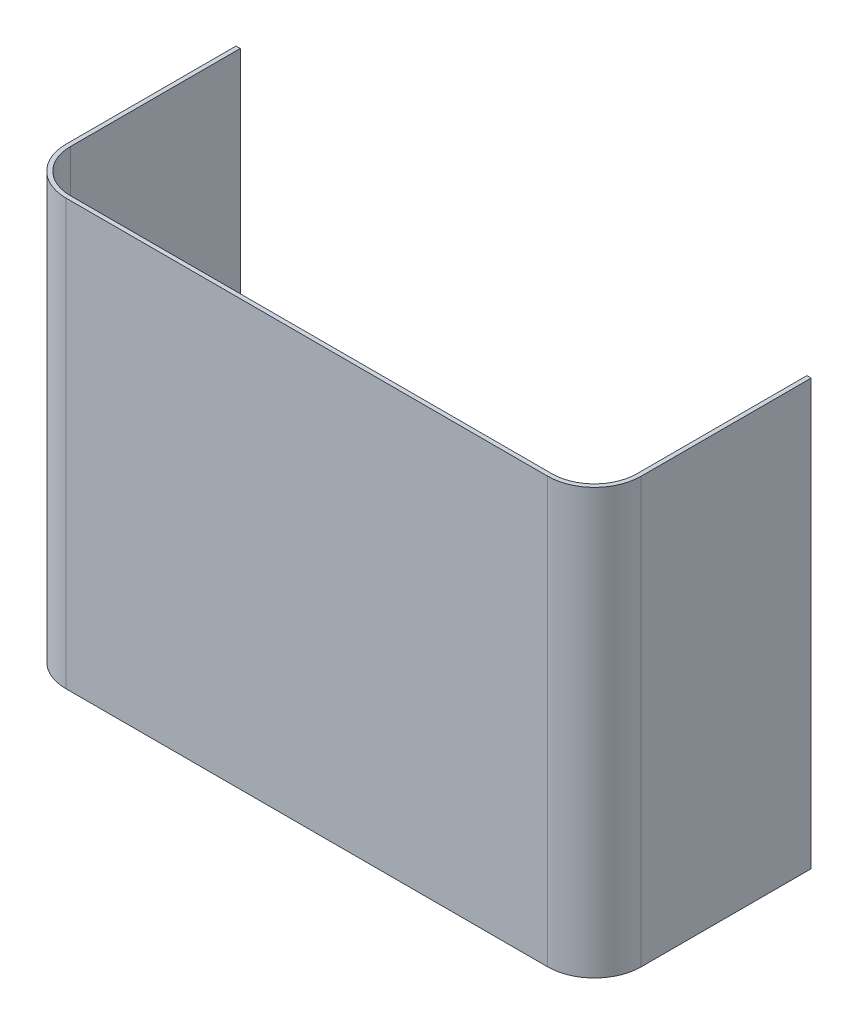
ISO-10303-21;
HEADER;
FILE_DESCRIPTION(('STEP AP214'),'2;1');
FILE_NAME('part.step','',(''),(''),'','','');
FILE_SCHEMA(('AUTOMOTIVE_DESIGN { 1 0 10303 214 1 1 1 1 }'));
ENDSEC;
DATA;
#1=APPLICATION_CONTEXT('core data for automotive mechanical design processes');
#2=APPLICATION_PROTOCOL_DEFINITION('international standard','automotive_design',2000,#1);
#3=PRODUCT_CONTEXT('',#1,'mechanical');
#4=PRODUCT('Part','Part','',(#3));
#5=PRODUCT_RELATED_PRODUCT_CATEGORY('part','',(#4));
#6=PRODUCT_DEFINITION_FORMATION('','',#4);
#7=PRODUCT_DEFINITION_CONTEXT('part definition',#1,'design');
#8=PRODUCT_DEFINITION('design','',#6,#7);
#9=PRODUCT_DEFINITION_SHAPE('','',#8);
#10=(LENGTH_UNIT() NAMED_UNIT(*) SI_UNIT(.MILLI.,.METRE.));
#11=(NAMED_UNIT(*) PLANE_ANGLE_UNIT() SI_UNIT($,.RADIAN.));
#12=(NAMED_UNIT(*) SI_UNIT($,.STERADIAN.) SOLID_ANGLE_UNIT());
#13=UNCERTAINTY_MEASURE_WITH_UNIT(LENGTH_MEASURE(1.E-05),#10,'distance_accuracy_value','');
#14=(GEOMETRIC_REPRESENTATION_CONTEXT(3) GLOBAL_UNCERTAINTY_ASSIGNED_CONTEXT((#13)) GLOBAL_UNIT_ASSIGNED_CONTEXT((#10,
#11,#12)) REPRESENTATION_CONTEXT('',''));
#15=CARTESIAN_POINT('',(0.,0.,0.));
#16=DIRECTION('',(0.,0.,1.));
#17=DIRECTION('',(1.,0.,0.));
#18=AXIS2_PLACEMENT_3D('',#15,#16,#17);
#19=CARTESIAN_POINT('',(-170.,0.,45.));
#20=DIRECTION('',(0.,-1.,0.));
#21=DIRECTION('',(0.,0.,-1.));
#22=AXIS2_PLACEMENT_3D('',#19,#20,#21);
#23=PLANE('',#22);
#24=DIRECTION('',(0.,0.,1.));
#25=VECTOR('',#24,1.);
#26=CARTESIAN_POINT('',(-203.,0.,45.));
#27=LINE('',#26,#25);
#28=CARTESIAN_POINT('',(-203.,0.,-75.));
#29=VERTEX_POINT('',#28);
#30=CARTESIAN_POINT('',(-203.,0.,45.));
#31=VERTEX_POINT('',#30);
#32=EDGE_CURVE('E40',#29,#31,#27,.T.);
#33=ORIENTED_EDGE('',*,*,#32,.F.);
#34=DIRECTION('',(1.,0.,0.));
#35=VECTOR('',#34,1.);
#36=CARTESIAN_POINT('',(-170.,0.,-75.));
#37=LINE('',#36,#35);
#38=CARTESIAN_POINT('',(-200.,0.,-75.));
#39=VERTEX_POINT('',#38);
#40=EDGE_CURVE('E181',#29,#39,#37,.T.);
#41=ORIENTED_EDGE('',*,*,#40,.T.);
#42=DIRECTION('',(0.,0.,1.));
#43=VECTOR('',#42,1.);
#44=CARTESIAN_POINT('',(-200.,0.,45.));
#45=LINE('',#44,#43);
#46=CARTESIAN_POINT('',(-200.,0.,45.));
#47=VERTEX_POINT('',#46);
#48=EDGE_CURVE('E172',#39,#47,#45,.T.);
#49=ORIENTED_EDGE('',*,*,#48,.T.);
#50=CARTESIAN_POINT('',(-170.,0.,45.));
#51=DIRECTION('',(0.,1.,0.));
#52=DIRECTION('',(0.,0.,-1.));
#53=AXIS2_PLACEMENT_3D('',#50,#51,#52);
#54=CIRCLE('',#53,30.);
#55=CARTESIAN_POINT('',(-170.,0.,75.));
#56=VERTEX_POINT('',#55);
#57=EDGE_CURVE('E164',#47,#56,#54,.T.);
#58=ORIENTED_EDGE('',*,*,#57,.T.);
#59=DIRECTION('',(1.,0.,0.));
#60=VECTOR('',#59,1.);
#61=CARTESIAN_POINT('',(-170.,0.,75.));
#62=LINE('',#61,#60);
#63=CARTESIAN_POINT('',(170.,0.,75.));
#64=VERTEX_POINT('',#63);
#65=EDGE_CURVE('E157',#56,#64,#62,.T.);
#66=ORIENTED_EDGE('',*,*,#65,.T.);
#67=CARTESIAN_POINT('',(170.,0.,45.));
#68=DIRECTION('',(0.,1.,0.));
#69=DIRECTION('',(0.,0.,-1.));
#70=AXIS2_PLACEMENT_3D('',#67,#68,#69);
#71=CIRCLE('',#70,30.);
#72=CARTESIAN_POINT('',(200.,0.,45.));
#73=VERTEX_POINT('',#72);
#74=EDGE_CURVE('E152',#64,#73,#71,.T.);
#75=ORIENTED_EDGE('',*,*,#74,.T.);
#76=DIRECTION('',(0.,0.,-1.));
#77=VECTOR('',#76,1.);
#78=CARTESIAN_POINT('',(200.,0.,45.));
#79=LINE('',#78,#77);
#80=CARTESIAN_POINT('',(200.,0.,-75.));
#81=VERTEX_POINT('',#80);
#82=EDGE_CURVE('E149',#73,#81,#79,.T.);
#83=ORIENTED_EDGE('',*,*,#82,.T.);
#84=CARTESIAN_POINT('',(203.,0.,-75.));
#85=VERTEX_POINT('',#84);
#86=EDGE_CURVE('E192',#81,#85,#37,.T.);
#87=ORIENTED_EDGE('',*,*,#86,.T.);
#88=DIRECTION('',(0.,0.,-1.));
#89=VECTOR('',#88,1.);
#90=CARTESIAN_POINT('',(203.,0.,45.));
#91=LINE('',#90,#89);
#92=CARTESIAN_POINT('',(203.,0.,45.));
#93=VERTEX_POINT('',#92);
#94=EDGE_CURVE('E131',#93,#85,#91,.T.);
#95=ORIENTED_EDGE('',*,*,#94,.F.);
#96=CARTESIAN_POINT('',(170.,0.,45.));
#97=DIRECTION('',(0.,-1.,0.));
#98=DIRECTION('',(0.,0.,-1.));
#99=AXIS2_PLACEMENT_3D('',#96,#97,#98);
#100=CIRCLE('',#99,33.);
#101=CARTESIAN_POINT('',(170.,0.,78.));
#102=VERTEX_POINT('',#101);
#103=EDGE_CURVE('E136',#102,#93,#100,.F.);
#104=ORIENTED_EDGE('',*,*,#103,.F.);
#105=DIRECTION('',(1.,0.,0.));
#106=VECTOR('',#105,1.);
#107=CARTESIAN_POINT('',(-170.,0.,78.));
#108=LINE('',#107,#106);
#109=CARTESIAN_POINT('',(-170.,0.,78.));
#110=VERTEX_POINT('',#109);
#111=EDGE_CURVE('E139',#110,#102,#108,.T.);
#112=ORIENTED_EDGE('',*,*,#111,.F.);
#113=CARTESIAN_POINT('',(-170.,0.,45.));
#114=DIRECTION('',(0.,-1.,0.));
#115=DIRECTION('',(0.,0.,-1.));
#116=AXIS2_PLACEMENT_3D('',#113,#114,#115);
#117=CIRCLE('',#116,33.);
#118=EDGE_CURVE('E123',#31,#110,#117,.F.);
#119=ORIENTED_EDGE('',*,*,#118,.F.);
#120=EDGE_LOOP('',(#33,#41,#49,#58,#66,#75,#83,#87,#95,#104,#112,#119));
#121=FACE_BOUND('',#120,.T.);
#122=ADVANCED_FACE('F36',(#121),#23,.T.);
#123=CARTESIAN_POINT('',(-170.,300.,44.999999999999));
#124=DIRECTION('',(0.,-1.,0.));
#125=DIRECTION('',(0.,0.,-1.));
#126=AXIS2_PLACEMENT_3D('',#123,#124,#125);
#127=PLANE('',#126);
#128=DIRECTION('',(1.,0.,0.));
#129=VECTOR('',#128,1.);
#130=CARTESIAN_POINT('',(-170.,300.,-75.000000000001));
#131=LINE('',#130,#129);
#132=CARTESIAN_POINT('',(-203.,300.,-75.000000000001));
#133=VERTEX_POINT('',#132);
#134=CARTESIAN_POINT('',(-200.,300.,-75.000000000001));
#135=VERTEX_POINT('',#134);
#136=EDGE_CURVE('E188',#133,#135,#131,.T.);
#137=ORIENTED_EDGE('',*,*,#136,.F.);
#138=DIRECTION('',(0.,0.,1.));
#139=VECTOR('',#138,1.);
#140=CARTESIAN_POINT('',(-203.,300.,45.));
#141=LINE('',#140,#139);
#142=CARTESIAN_POINT('',(-203.,300.,44.999999999999));
#143=VERTEX_POINT('',#142);
#144=EDGE_CURVE('E106',#133,#143,#141,.T.);
#145=ORIENTED_EDGE('',*,*,#144,.T.);
#146=CARTESIAN_POINT('',(-170.,300.,44.999999999999));
#147=DIRECTION('',(0.,-1.,0.));
#148=DIRECTION('',(0.,0.,-1.));
#149=AXIS2_PLACEMENT_3D('',#146,#147,#148);
#150=CIRCLE('',#149,33.);
#151=CARTESIAN_POINT('',(-170.,300.,77.999999999999));
#152=VERTEX_POINT('',#151);
#153=EDGE_CURVE('E100',#143,#152,#150,.F.);
#154=ORIENTED_EDGE('',*,*,#153,.T.);
#155=DIRECTION('',(1.,0.,0.));
#156=VECTOR('',#155,1.);
#157=CARTESIAN_POINT('',(-170.,300.,77.999999999999));
#158=LINE('',#157,#156);
#159=CARTESIAN_POINT('',(170.,300.,77.999999999999));
#160=VERTEX_POINT('',#159);
#161=EDGE_CURVE('E104',#152,#160,#158,.T.);
#162=ORIENTED_EDGE('',*,*,#161,.T.);
#163=CARTESIAN_POINT('',(170.,300.,44.999999999999));
#164=DIRECTION('',(0.,-1.,0.));
#165=DIRECTION('',(0.,0.,-1.));
#166=AXIS2_PLACEMENT_3D('',#163,#164,#165);
#167=CIRCLE('',#166,33.);
#168=CARTESIAN_POINT('',(203.,300.,44.999999999999));
#169=VERTEX_POINT('',#168);
#170=EDGE_CURVE('E61',#160,#169,#167,.F.);
#171=ORIENTED_EDGE('',*,*,#170,.T.);
#172=DIRECTION('',(0.,0.,-1.));
#173=VECTOR('',#172,1.);
#174=CARTESIAN_POINT('',(203.,300.,45.));
#175=LINE('',#174,#173);
#176=CARTESIAN_POINT('',(203.,300.,-75.000000000001));
#177=VERTEX_POINT('',#176);
#178=EDGE_CURVE('E11',#169,#177,#175,.T.);
#179=ORIENTED_EDGE('',*,*,#178,.T.);
#180=CARTESIAN_POINT('',(200.,300.,-75.000000000001));
#181=VERTEX_POINT('',#180);
#182=EDGE_CURVE('E195',#181,#177,#131,.T.);
#183=ORIENTED_EDGE('',*,*,#182,.F.);
#184=DIRECTION('',(0.,0.,-1.));
#185=VECTOR('',#184,1.);
#186=CARTESIAN_POINT('',(200.,300.,44.999999999999));
#187=LINE('',#186,#185);
#188=CARTESIAN_POINT('',(200.,300.,44.999999999999));
#189=VERTEX_POINT('',#188);
#190=EDGE_CURVE('E140',#189,#181,#187,.T.);
#191=ORIENTED_EDGE('',*,*,#190,.F.);
#192=CARTESIAN_POINT('',(170.,300.,44.999999999999));
#193=DIRECTION('',(0.,1.,0.));
#194=DIRECTION('',(0.,0.,-1.));
#195=AXIS2_PLACEMENT_3D('',#192,#193,#194);
#196=CIRCLE('',#195,30.);
#197=CARTESIAN_POINT('',(170.,300.,74.999999999999));
#198=VERTEX_POINT('',#197);
#199=EDGE_CURVE('E88',#198,#189,#196,.T.);
#200=ORIENTED_EDGE('',*,*,#199,.F.);
#201=DIRECTION('',(1.,0.,0.));
#202=VECTOR('',#201,1.);
#203=CARTESIAN_POINT('',(-170.,300.,74.999999999999));
#204=LINE('',#203,#202);
#205=CARTESIAN_POINT('',(-170.,300.,74.999999999999));
#206=VERTEX_POINT('',#205);
#207=EDGE_CURVE('E159',#206,#198,#204,.T.);
#208=ORIENTED_EDGE('',*,*,#207,.F.);
#209=CARTESIAN_POINT('',(-170.,300.,44.999999999999));
#210=DIRECTION('',(0.,1.,0.));
#211=DIRECTION('',(0.,0.,-1.));
#212=AXIS2_PLACEMENT_3D('',#209,#210,#211);
#213=CIRCLE('',#212,30.);
#214=CARTESIAN_POINT('',(-200.,300.,44.999999999999));
#215=VERTEX_POINT('',#214);
#216=EDGE_CURVE('E167',#215,#206,#213,.T.);
#217=ORIENTED_EDGE('',*,*,#216,.F.);
#218=DIRECTION('',(0.,0.,1.));
#219=VECTOR('',#218,1.);
#220=CARTESIAN_POINT('',(-200.,300.,44.999999999999));
#221=LINE('',#220,#219);
#222=EDGE_CURVE('E175',#135,#215,#221,.T.);
#223=ORIENTED_EDGE('',*,*,#222,.F.);
#224=EDGE_LOOP('',(#137,#145,#154,#162,#171,#179,#183,#191,#200,#208,#217,#223));
#225=FACE_BOUND('',#224,.T.);
#226=ADVANCED_FACE('F103',(#225),#127,.F.);
#227=CARTESIAN_POINT('',(-203.,0.,45.));
#228=DIRECTION('',(-1.,0.,0.));
#229=DIRECTION('',(0.,0.,1.));
#230=AXIS2_PLACEMENT_3D('',#227,#228,#229);
#231=PLANE('',#230);
#232=ORIENTED_EDGE('',*,*,#144,.F.);
#233=DIRECTION('',(0.,-1.,0.));
#234=VECTOR('',#233,1.);
#235=CARTESIAN_POINT('',(-203.,-4.04834597446372E-13,-75.));
#236=LINE('',#235,#234);
#237=EDGE_CURVE('E186',#133,#29,#236,.T.);
#238=ORIENTED_EDGE('',*,*,#237,.T.);
#239=ORIENTED_EDGE('',*,*,#32,.T.);
#240=DIRECTION('',(0.,1.,0.));
#241=VECTOR('',#240,1.);
#242=CARTESIAN_POINT('',(-203.,0.,45.));
#243=LINE('',#242,#241);
#244=EDGE_CURVE('E111',#31,#143,#243,.T.);
#245=ORIENTED_EDGE('',*,*,#244,.T.);
#246=EDGE_LOOP('',(#232,#238,#239,#245));
#247=FACE_BOUND('',#246,.T.);
#248=ADVANCED_FACE('F264',(#247),#231,.T.);
#249=CARTESIAN_POINT('',(203.,0.,45.));
#250=DIRECTION('',(1.,0.,0.));
#251=DIRECTION('',(0.,0.,-1.));
#252=AXIS2_PLACEMENT_3D('',#249,#250,#251);
#253=PLANE('',#252);
#254=ORIENTED_EDGE('',*,*,#94,.T.);
#255=DIRECTION('',(0.,1.,0.));
#256=VECTOR('',#255,1.);
#257=CARTESIAN_POINT('',(203.,-4.04834597446372E-13,-75.));
#258=LINE('',#257,#256);
#259=EDGE_CURVE('E189',#85,#177,#258,.T.);
#260=ORIENTED_EDGE('',*,*,#259,.T.);
#261=ORIENTED_EDGE('',*,*,#178,.F.);
#262=DIRECTION('',(0.,1.,0.));
#263=VECTOR('',#262,1.);
#264=CARTESIAN_POINT('',(203.,0.,45.));
#265=LINE('',#264,#263);
#266=EDGE_CURVE('E45',#93,#169,#265,.T.);
#267=ORIENTED_EDGE('',*,*,#266,.F.);
#268=EDGE_LOOP('',(#254,#260,#261,#267));
#269=FACE_BOUND('',#268,.T.);
#270=ADVANCED_FACE('F38',(#269),#253,.T.);
#271=CARTESIAN_POINT('',(-170.,0.,45.));
#272=DIRECTION('',(0.,1.,0.));
#273=DIRECTION('',(0.,0.,1.));
#274=AXIS2_PLACEMENT_3D('',#271,#272,#273);
#275=CYLINDRICAL_SURFACE('',#274,33.);
#276=DIRECTION('',(0.,1.,0.));
#277=VECTOR('',#276,1.);
#278=CARTESIAN_POINT('',(-170.,1.11177549744637E-13,78.));
#279=LINE('',#278,#277);
#280=EDGE_CURVE('E110',#110,#152,#279,.T.);
#281=ORIENTED_EDGE('',*,*,#280,.T.);
#282=ORIENTED_EDGE('',*,*,#153,.F.);
#283=ORIENTED_EDGE('',*,*,#244,.F.);
#284=ORIENTED_EDGE('',*,*,#118,.T.);
#285=EDGE_LOOP('',(#281,#282,#283,#284));
#286=FACE_BOUND('',#285,.T.);
#287=ADVANCED_FACE('F122',(#286),#275,.T.);
#288=CARTESIAN_POINT('',(-170.,0.,78.));
#289=DIRECTION('',(0.,0.,1.));
#290=DIRECTION('',(0.,-1.,0.));
#291=AXIS2_PLACEMENT_3D('',#288,#289,#290);
#292=PLANE('',#291);
#293=DIRECTION('',(0.,-1.,0.));
#294=VECTOR('',#293,1.);
#295=CARTESIAN_POINT('',(170.,0.,78.));
#296=LINE('',#295,#294);
#297=EDGE_CURVE('E119',#102,#160,#296,.F.);
#298=ORIENTED_EDGE('',*,*,#297,.T.);
#299=ORIENTED_EDGE('',*,*,#161,.F.);
#300=ORIENTED_EDGE('',*,*,#280,.F.);
#301=ORIENTED_EDGE('',*,*,#111,.T.);
#302=EDGE_LOOP('',(#298,#299,#300,#301));
#303=FACE_BOUND('',#302,.T.);
#304=ADVANCED_FACE('F116',(#303),#292,.T.);
#305=CARTESIAN_POINT('',(170.,0.,45.));
#306=DIRECTION('',(0.,1.,0.));
#307=DIRECTION('',(0.,0.,1.));
#308=AXIS2_PLACEMENT_3D('',#305,#306,#307);
#309=CYLINDRICAL_SURFACE('',#308,33.);
#310=ORIENTED_EDGE('',*,*,#266,.T.);
#311=ORIENTED_EDGE('',*,*,#170,.F.);
#312=ORIENTED_EDGE('',*,*,#297,.F.);
#313=ORIENTED_EDGE('',*,*,#103,.T.);
#314=EDGE_LOOP('',(#310,#311,#312,#313));
#315=FACE_BOUND('',#314,.T.);
#316=ADVANCED_FACE('F248',(#315),#309,.T.);
#317=CARTESIAN_POINT('',(-200.,0.,45.));
#318=DIRECTION('',(-1.,0.,0.));
#319=DIRECTION('',(0.,0.,1.));
#320=AXIS2_PLACEMENT_3D('',#317,#318,#319);
#321=PLANE('',#320);
#322=DIRECTION('',(0.,1.,0.));
#323=VECTOR('',#322,1.);
#324=CARTESIAN_POINT('',(-200.,0.,45.));
#325=LINE('',#324,#323);
#326=EDGE_CURVE('E169',#47,#215,#325,.T.);
#327=ORIENTED_EDGE('',*,*,#326,.F.);
#328=ORIENTED_EDGE('',*,*,#48,.F.);
#329=DIRECTION('',(0.,1.,0.));
#330=VECTOR('',#329,1.);
#331=CARTESIAN_POINT('',(-200.,0.,-75.));
#332=LINE('',#331,#330);
#333=EDGE_CURVE('E178',#39,#135,#332,.T.);
#334=ORIENTED_EDGE('',*,*,#333,.T.);
#335=ORIENTED_EDGE('',*,*,#222,.T.);
#336=EDGE_LOOP('',(#327,#328,#334,#335));
#337=FACE_BOUND('',#336,.T.);
#338=ADVANCED_FACE('F218',(#337),#321,.F.);
#339=CARTESIAN_POINT('',(-170.,0.,45.));
#340=DIRECTION('',(0.,1.,0.));
#341=DIRECTION('',(0.,0.,1.));
#342=AXIS2_PLACEMENT_3D('',#339,#340,#341);
#343=CYLINDRICAL_SURFACE('',#342,30.);
#344=DIRECTION('',(0.,1.,0.));
#345=VECTOR('',#344,1.);
#346=CARTESIAN_POINT('',(-170.,0.,75.));
#347=LINE('',#346,#345);
#348=EDGE_CURVE('E161',#56,#206,#347,.T.);
#349=ORIENTED_EDGE('',*,*,#348,.F.);
#350=ORIENTED_EDGE('',*,*,#57,.F.);
#351=ORIENTED_EDGE('',*,*,#326,.T.);
#352=ORIENTED_EDGE('',*,*,#216,.T.);
#353=EDGE_LOOP('',(#349,#350,#351,#352));
#354=FACE_BOUND('',#353,.T.);
#355=ADVANCED_FACE('F227',(#354),#343,.F.);
#356=CARTESIAN_POINT('',(-170.,0.,75.));
#357=DIRECTION('',(0.,0.,1.));
#358=DIRECTION('',(0.,-1.,0.));
#359=AXIS2_PLACEMENT_3D('',#356,#357,#358);
#360=PLANE('',#359);
#361=DIRECTION('',(0.,1.,0.));
#362=VECTOR('',#361,1.);
#363=CARTESIAN_POINT('',(170.,0.,75.));
#364=LINE('',#363,#362);
#365=EDGE_CURVE('E53',#64,#198,#364,.T.);
#366=ORIENTED_EDGE('',*,*,#365,.F.);
#367=ORIENTED_EDGE('',*,*,#65,.F.);
#368=ORIENTED_EDGE('',*,*,#348,.T.);
#369=ORIENTED_EDGE('',*,*,#207,.T.);
#370=EDGE_LOOP('',(#366,#367,#368,#369));
#371=FACE_BOUND('',#370,.T.);
#372=ADVANCED_FACE('F231',(#371),#360,.F.);
#373=CARTESIAN_POINT('',(170.,0.,45.));
#374=DIRECTION('',(0.,1.,0.));
#375=DIRECTION('',(0.,0.,1.));
#376=AXIS2_PLACEMENT_3D('',#373,#374,#375);
#377=CYLINDRICAL_SURFACE('',#376,30.);
#378=DIRECTION('',(0.,1.,0.));
#379=VECTOR('',#378,1.);
#380=CARTESIAN_POINT('',(200.,0.,45.));
#381=LINE('',#380,#379);
#382=EDGE_CURVE('E142',#73,#189,#381,.T.);
#383=ORIENTED_EDGE('',*,*,#382,.F.);
#384=ORIENTED_EDGE('',*,*,#74,.F.);
#385=ORIENTED_EDGE('',*,*,#365,.T.);
#386=ORIENTED_EDGE('',*,*,#199,.T.);
#387=EDGE_LOOP('',(#383,#384,#385,#386));
#388=FACE_BOUND('',#387,.T.);
#389=ADVANCED_FACE('F250',(#388),#377,.F.);
#390=CARTESIAN_POINT('',(200.,0.,45.));
#391=DIRECTION('',(1.,0.,0.));
#392=DIRECTION('',(0.,0.,-1.));
#393=AXIS2_PLACEMENT_3D('',#390,#391,#392);
#394=PLANE('',#393);
#395=ORIENTED_EDGE('',*,*,#190,.T.);
#396=DIRECTION('',(0.,1.,0.));
#397=VECTOR('',#396,1.);
#398=CARTESIAN_POINT('',(200.,0.,-75.));
#399=LINE('',#398,#397);
#400=EDGE_CURVE('E151',#81,#181,#399,.T.);
#401=ORIENTED_EDGE('',*,*,#400,.F.);
#402=ORIENTED_EDGE('',*,*,#82,.F.);
#403=ORIENTED_EDGE('',*,*,#382,.T.);
#404=EDGE_LOOP('',(#395,#401,#402,#403));
#405=FACE_BOUND('',#404,.T.);
#406=ADVANCED_FACE('F249',(#405),#394,.F.);
#407=CARTESIAN_POINT('',(0.,-2.53035438363357E-13,-75.));
#408=DIRECTION('',(0.,0.,-1.));
#409=DIRECTION('',(0.,1.,0.));
#410=AXIS2_PLACEMENT_3D('',#407,#408,#409);
#411=PLANE('',#410);
#412=ORIENTED_EDGE('',*,*,#86,.F.);
#413=ORIENTED_EDGE('',*,*,#400,.T.);
#414=ORIENTED_EDGE('',*,*,#182,.T.);
#415=ORIENTED_EDGE('',*,*,#259,.F.);
#416=EDGE_LOOP('',(#412,#413,#414,#415));
#417=FACE_BOUND('',#416,.T.);
#418=ADVANCED_FACE('F244',(#417),#411,.T.);
#419=ORIENTED_EDGE('',*,*,#237,.F.);
#420=ORIENTED_EDGE('',*,*,#136,.T.);
#421=ORIENTED_EDGE('',*,*,#333,.F.);
#422=ORIENTED_EDGE('',*,*,#40,.F.);
#423=EDGE_LOOP('',(#419,#420,#421,#422));
#424=FACE_BOUND('',#423,.T.);
#425=ADVANCED_FACE('F346',(#424),#411,.T.);
#426=CLOSED_SHELL('',(#122,#226,#248,#270,#287,#304,#316,#338,#355,#372,#389,#406,#418,#425));
#427=MANIFOLD_SOLID_BREP('B2',#426);
#428=ADVANCED_BREP_SHAPE_REPRESENTATION('',(#18,#427),#14);
#429=SHAPE_DEFINITION_REPRESENTATION(#9,#428);
ENDSEC;
END-ISO-10303-21;
